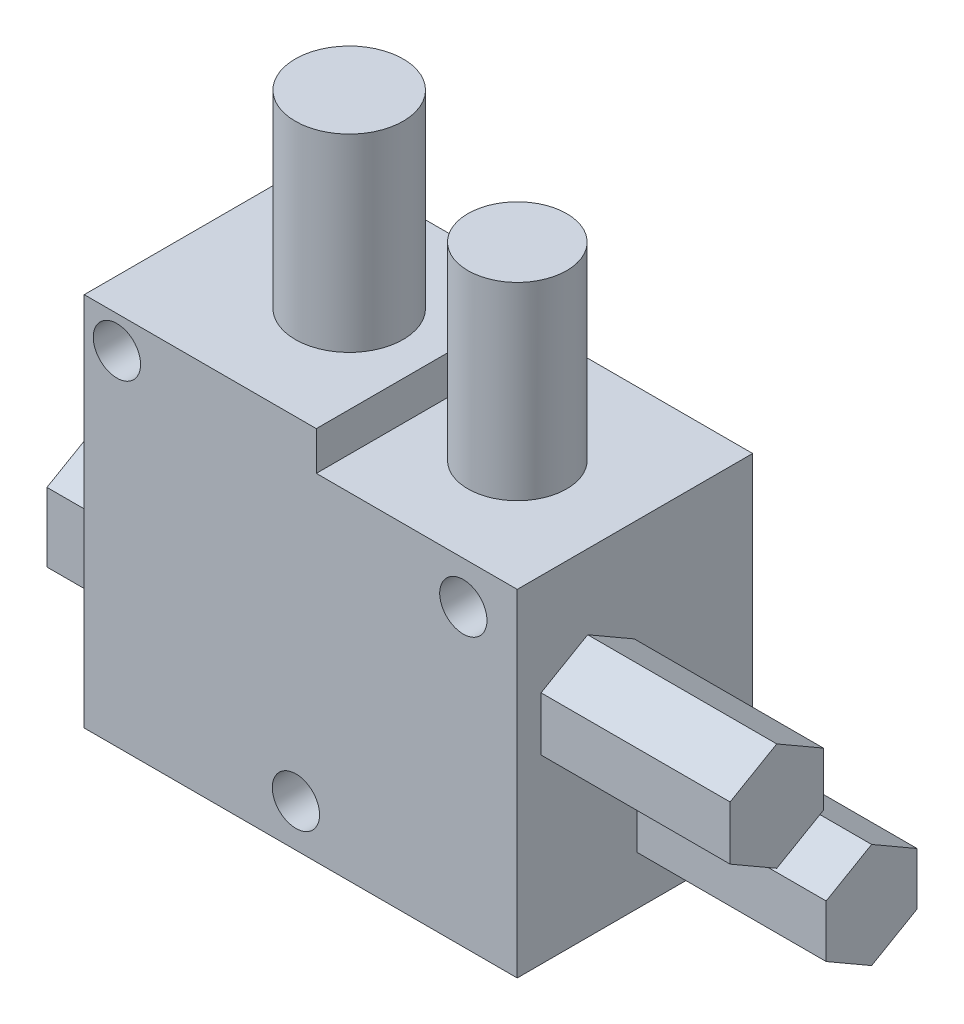
ISO-10303-21;
HEADER;
FILE_DESCRIPTION(('STEP AP214'),'2;1');
FILE_NAME('part.step','',(''),(''),'','','');
FILE_SCHEMA(('AUTOMOTIVE_DESIGN { 1 0 10303 214 1 1 1 1 }'));
ENDSEC;
DATA;
#1=APPLICATION_CONTEXT('core data for automotive mechanical design processes');
#2=APPLICATION_PROTOCOL_DEFINITION('international standard','automotive_design',2000,#1);
#3=PRODUCT_CONTEXT('',#1,'mechanical');
#4=PRODUCT('Part','Part','',(#3));
#5=PRODUCT_RELATED_PRODUCT_CATEGORY('part','',(#4));
#6=PRODUCT_DEFINITION_FORMATION('','',#4);
#7=PRODUCT_DEFINITION_CONTEXT('part definition',#1,'design');
#8=PRODUCT_DEFINITION('design','',#6,#7);
#9=PRODUCT_DEFINITION_SHAPE('','',#8);
#10=(LENGTH_UNIT() NAMED_UNIT(*) SI_UNIT(.MILLI.,.METRE.));
#11=(NAMED_UNIT(*) PLANE_ANGLE_UNIT() SI_UNIT($,.RADIAN.));
#12=(NAMED_UNIT(*) SI_UNIT($,.STERADIAN.) SOLID_ANGLE_UNIT());
#13=UNCERTAINTY_MEASURE_WITH_UNIT(LENGTH_MEASURE(1.E-05),#10,'distance_accuracy_value','');
#14=(GEOMETRIC_REPRESENTATION_CONTEXT(3) GLOBAL_UNCERTAINTY_ASSIGNED_CONTEXT((#13)) GLOBAL_UNIT_ASSIGNED_CONTEXT((#10,
#11,#12)) REPRESENTATION_CONTEXT('',''));
#15=CARTESIAN_POINT('',(0.,0.,0.));
#16=DIRECTION('',(0.,0.,1.));
#17=DIRECTION('',(1.,0.,0.));
#18=AXIS2_PLACEMENT_3D('',#15,#16,#17);
#19=CARTESIAN_POINT('',(-43.8925925925926,53.9952674897119,24.9));
#20=DIRECTION('',(-1.,0.,0.));
#21=DIRECTION('',(0.,-1.,0.));
#22=AXIS2_PLACEMENT_3D('',#19,#20,#21);
#23=PLANE('',#22);
#24=DIRECTION('',(0.,-0.499999999999995,-0.866025403784441));
#25=VECTOR('',#24,1.);
#26=CARTESIAN_POINT('',(-43.8925925925926,33.4669277376455,22.3833900106311));
#27=LINE('',#26,#25);
#28=CARTESIAN_POINT('',(-43.8925925925926,33.4669277376455,22.3833900106311));
#29=VERTEX_POINT('',#28);
#30=CARTESIAN_POINT('',(-43.8925925925926,30.6181451876106,17.4491538942549));
#31=VERTEX_POINT('',#30);
#32=EDGE_CURVE('E218',#29,#31,#27,.T.);
#33=ORIENTED_EDGE('',*,*,#32,.F.);
#34=DIRECTION('',(0.,-1.,0.));
#35=VECTOR('',#34,1.);
#36=CARTESIAN_POINT('',(-43.8925925925926,39.1644928377154,22.3833900106311));
#37=LINE('',#36,#35);
#38=CARTESIAN_POINT('',(-43.8925925925926,39.1644928377155,22.3833900106311));
#39=VERTEX_POINT('',#38);
#40=EDGE_CURVE('E231',#39,#29,#37,.T.);
#41=ORIENTED_EDGE('',*,*,#40,.F.);
#42=DIRECTION('',(0.,-0.500000000000007,0.866025403784434));
#43=VECTOR('',#42,1.);
#44=CARTESIAN_POINT('',(-43.8925925925926,42.0132753877505,17.449153894255));
#45=LINE('',#44,#43);
#46=CARTESIAN_POINT('',(-43.8925925925926,42.0132753877505,17.449153894255));
#47=VERTEX_POINT('',#46);
#48=EDGE_CURVE('E250',#47,#39,#45,.T.);
#49=ORIENTED_EDGE('',*,*,#48,.F.);
#50=DIRECTION('',(0.,0.499999999999995,0.866025403784441));
#51=VECTOR('',#50,1.);
#52=CARTESIAN_POINT('',(-43.8925925925926,39.1644928377155,12.5149177778787));
#53=LINE('',#52,#51);
#54=CARTESIAN_POINT('',(-43.8925925925926,39.1644928377155,12.5149177778787));
#55=VERTEX_POINT('',#54);
#56=EDGE_CURVE('E247',#55,#47,#53,.T.);
#57=ORIENTED_EDGE('',*,*,#56,.F.);
#58=DIRECTION('',(0.,1.,0.));
#59=VECTOR('',#58,1.);
#60=CARTESIAN_POINT('',(-43.8925925925926,33.4669277376456,12.5149177778787));
#61=LINE('',#60,#59);
#62=CARTESIAN_POINT('',(-43.8925925925926,33.4669277376456,12.5149177778787));
#63=VERTEX_POINT('',#62);
#64=EDGE_CURVE('E244',#63,#55,#61,.T.);
#65=ORIENTED_EDGE('',*,*,#64,.F.);
#66=DIRECTION('',(0.,0.500000000000001,-0.866025403784438));
#67=VECTOR('',#66,1.);
#68=CARTESIAN_POINT('',(-43.8925925925926,30.6181451876106,17.4491538942549));
#69=LINE('',#68,#67);
#70=EDGE_CURVE('E221',#31,#63,#69,.T.);
#71=ORIENTED_EDGE('',*,*,#70,.F.);
#72=EDGE_LOOP('',(#33,#41,#49,#57,#65,#71));
#73=FACE_BOUND('',#72,.T.);
#74=DIRECTION('',(0.,1.,0.));
#75=VECTOR('',#74,1.);
#76=CARTESIAN_POINT('',(-43.8925925925926,53.9952674897119,0.));
#77=LINE('',#76,#75);
#78=CARTESIAN_POINT('',(-43.8925925925926,14.2952674897119,0.));
#79=VERTEX_POINT('',#78);
#80=CARTESIAN_POINT('',(-43.8925925925926,49.8952674897119,0.));
#81=VERTEX_POINT('',#80);
#82=EDGE_CURVE('E365',#79,#81,#77,.T.);
#83=ORIENTED_EDGE('',*,*,#82,.T.);
#84=DIRECTION('',(0.,0.,1.));
#85=VECTOR('',#84,1.);
#86=CARTESIAN_POINT('',(-43.8925925925926,49.8952674897119,0.));
#87=LINE('',#86,#85);
#88=CARTESIAN_POINT('',(-43.8925925925926,49.8952674897119,24.9));
#89=VERTEX_POINT('',#88);
#90=EDGE_CURVE('E342',#81,#89,#87,.T.);
#91=ORIENTED_EDGE('',*,*,#90,.T.);
#92=DIRECTION('',(0.,1.,0.));
#93=VECTOR('',#92,1.);
#94=CARTESIAN_POINT('',(-43.8925925925926,53.9952674897119,24.9));
#95=LINE('',#94,#93);
#96=CARTESIAN_POINT('',(-43.8925925925926,14.2952674897119,24.9));
#97=VERTEX_POINT('',#96);
#98=EDGE_CURVE('E355',#97,#89,#95,.T.);
#99=ORIENTED_EDGE('',*,*,#98,.F.);
#100=DIRECTION('',(0.,0.,-1.));
#101=VECTOR('',#100,1.);
#102=CARTESIAN_POINT('',(-43.8925925925926,14.2952674897119,24.9));
#103=LINE('',#102,#101);
#104=EDGE_CURVE('E371',#97,#79,#103,.T.);
#105=ORIENTED_EDGE('',*,*,#104,.T.);
#106=EDGE_LOOP('',(#83,#91,#99,#105));
#107=FACE_BOUND('',#106,.T.);
#108=DIRECTION('',(0.,-0.499999999999995,-0.866025403784441));
#109=VECTOR('',#108,1.);
#110=CARTESIAN_POINT('',(-43.8925925925926,19.4619451368284,12.2209886120208));
#111=LINE('',#110,#109);
#112=CARTESIAN_POINT('',(-43.8925925925926,19.4619451368284,12.2209886120208));
#113=VERTEX_POINT('',#112);
#114=CARTESIAN_POINT('',(-43.8925925925926,16.6866795558266,7.4140876212285));
#115=VERTEX_POINT('',#114);
#116=EDGE_CURVE('E217',#113,#115,#111,.T.);
#117=ORIENTED_EDGE('',*,*,#116,.F.);
#118=DIRECTION('',(0.,-1.,0.));
#119=VECTOR('',#118,1.);
#120=CARTESIAN_POINT('',(-43.8925925925926,25.012476298832,12.2209886120208));
#121=LINE('',#120,#119);
#122=CARTESIAN_POINT('',(-43.8925925925926,25.012476298832,12.2209886120208));
#123=VERTEX_POINT('',#122);
#124=EDGE_CURVE('E214',#123,#113,#121,.T.);
#125=ORIENTED_EDGE('',*,*,#124,.F.);
#126=DIRECTION('',(0.,-0.500000000000007,0.866025403784434));
#127=VECTOR('',#126,1.);
#128=CARTESIAN_POINT('',(-43.8925925925926,27.7877418798339,7.41408762122854));
#129=LINE('',#128,#127);
#130=CARTESIAN_POINT('',(-43.8925925925926,27.7877418798339,7.41408762122854));
#131=VERTEX_POINT('',#130);
#132=EDGE_CURVE('E395',#131,#123,#129,.T.);
#133=ORIENTED_EDGE('',*,*,#132,.F.);
#134=DIRECTION('',(0.,0.499999999999995,0.866025403784441));
#135=VECTOR('',#134,1.);
#136=CARTESIAN_POINT('',(-43.8925925925926,25.0124762988321,2.60718663043621));
#137=LINE('',#136,#135);
#138=CARTESIAN_POINT('',(-43.8925925925926,25.0124762988321,2.60718663043621));
#139=VERTEX_POINT('',#138);
#140=EDGE_CURVE('E392',#139,#131,#137,.T.);
#141=ORIENTED_EDGE('',*,*,#140,.F.);
#142=DIRECTION('',(0.,1.,0.));
#143=VECTOR('',#142,1.);
#144=CARTESIAN_POINT('',(-43.8925925925926,19.4619451368285,2.6071866304362));
#145=LINE('',#144,#143);
#146=CARTESIAN_POINT('',(-43.8925925925926,19.4619451368285,2.60718663043619));
#147=VERTEX_POINT('',#146);
#148=EDGE_CURVE('E56',#147,#139,#145,.T.);
#149=ORIENTED_EDGE('',*,*,#148,.F.);
#150=DIRECTION('',(0.,0.500000000000001,-0.866025403784438));
#151=VECTOR('',#150,1.);
#152=CARTESIAN_POINT('',(-43.8925925925926,16.6866795558267,7.4140876212285));
#153=LINE('',#152,#151);
#154=EDGE_CURVE('E51',#115,#147,#153,.T.);
#155=ORIENTED_EDGE('',*,*,#154,.F.);
#156=EDGE_LOOP('',(#117,#125,#133,#141,#149,#155));
#157=FACE_BOUND('',#156,.T.);
#158=ADVANCED_FACE('F34',(#73,#107,#157),#23,.F.);
#159=CARTESIAN_POINT('',(-89.6925925925926,53.9952674897119,24.9));
#160=DIRECTION('',(1.,0.,0.));
#161=DIRECTION('',(0.,0.,-1.));
#162=AXIS2_PLACEMENT_3D('',#159,#160,#161);
#163=PLANE('',#162);
#164=DIRECTION('',(0.,-1.,0.));
#165=VECTOR('',#164,1.);
#166=CARTESIAN_POINT('',(-89.6925925925926,53.9952674897119,0.));
#167=LINE('',#166,#165);
#168=CARTESIAN_POINT('',(-89.6925925925926,53.9952674897119,0.));
#169=VERTEX_POINT('',#168);
#170=CARTESIAN_POINT('',(-89.6925925925926,14.2952674897119,0.));
#171=VERTEX_POINT('',#170);
#172=EDGE_CURVE('E345',#169,#171,#167,.T.);
#173=ORIENTED_EDGE('',*,*,#172,.T.);
#174=DIRECTION('',(0.,0.,-1.));
#175=VECTOR('',#174,1.);
#176=CARTESIAN_POINT('',(-89.6925925925926,14.2952674897119,24.9));
#177=LINE('',#176,#175);
#178=CARTESIAN_POINT('',(-89.6925925925926,14.2952674897119,24.9));
#179=VERTEX_POINT('',#178);
#180=EDGE_CURVE('E330',#179,#171,#177,.T.);
#181=ORIENTED_EDGE('',*,*,#180,.F.);
#182=DIRECTION('',(0.,-1.,0.));
#183=VECTOR('',#182,1.);
#184=CARTESIAN_POINT('',(-89.6925925925926,53.9952674897119,24.9));
#185=LINE('',#184,#183);
#186=CARTESIAN_POINT('',(-89.6925925925926,53.9952674897119,24.9));
#187=VERTEX_POINT('',#186);
#188=EDGE_CURVE('E349',#187,#179,#185,.T.);
#189=ORIENTED_EDGE('',*,*,#188,.F.);
#190=DIRECTION('',(0.,0.,-1.));
#191=VECTOR('',#190,1.);
#192=CARTESIAN_POINT('',(-89.6925925925926,53.9952674897119,24.9));
#193=LINE('',#192,#191);
#194=EDGE_CURVE('E360',#187,#169,#193,.T.);
#195=ORIENTED_EDGE('',*,*,#194,.T.);
#196=EDGE_LOOP('',(#173,#181,#189,#195));
#197=FACE_BOUND('',#196,.T.);
#198=DIRECTION('',(0.,0.5,0.866025403784438));
#199=VECTOR('',#198,1.);
#200=CARTESIAN_POINT('',(-89.6925925925926,17.3627234957808,12.5235169690332));
#201=LINE('',#200,#199);
#202=CARTESIAN_POINT('',(-89.6925925925926,17.3627234957808,12.5235169690332));
#203=VERTEX_POINT('',#202);
#204=CARTESIAN_POINT('',(-89.6925925925926,21.0129970958527,18.845976305885));
#205=VERTEX_POINT('',#204);
#206=EDGE_CURVE('E272',#203,#205,#201,.T.);
#207=ORIENTED_EDGE('',*,*,#206,.F.);
#208=DIRECTION('',(0.,-0.5,0.866025403784439));
#209=VECTOR('',#208,1.);
#210=CARTESIAN_POINT('',(-89.6925925925926,21.0129970958527,6.20105763218134));
#211=LINE('',#210,#209);
#212=CARTESIAN_POINT('',(-89.6925925925926,21.0129970958527,6.20105763218134));
#213=VERTEX_POINT('',#212);
#214=EDGE_CURVE('E277',#213,#203,#211,.T.);
#215=ORIENTED_EDGE('',*,*,#214,.F.);
#216=DIRECTION('',(0.,-1.,0.));
#217=VECTOR('',#216,1.);
#218=CARTESIAN_POINT('',(-89.6925925925926,28.3135442959964,6.20105763218134));
#219=LINE('',#218,#217);
#220=CARTESIAN_POINT('',(-89.6925925925926,28.3135442959964,6.20105763218134));
#221=VERTEX_POINT('',#220);
#222=EDGE_CURVE('E299',#221,#213,#219,.T.);
#223=ORIENTED_EDGE('',*,*,#222,.F.);
#224=DIRECTION('',(0.,-0.5,-0.866025403784438));
#225=VECTOR('',#224,1.);
#226=CARTESIAN_POINT('',(-89.6925925925926,31.9638178960683,12.5235169690332));
#227=LINE('',#226,#225);
#228=CARTESIAN_POINT('',(-89.6925925925926,31.9638178960683,12.5235169690332));
#229=VERTEX_POINT('',#228);
#230=EDGE_CURVE('E296',#229,#221,#227,.T.);
#231=ORIENTED_EDGE('',*,*,#230,.F.);
#232=DIRECTION('',(0.,0.5,-0.866025403784439));
#233=VECTOR('',#232,1.);
#234=CARTESIAN_POINT('',(-89.6925925925926,28.3135442959964,18.845976305885));
#235=LINE('',#234,#233);
#236=CARTESIAN_POINT('',(-89.6925925925926,28.3135442959964,18.845976305885));
#237=VERTEX_POINT('',#236);
#238=EDGE_CURVE('E293',#237,#229,#235,.T.);
#239=ORIENTED_EDGE('',*,*,#238,.F.);
#240=DIRECTION('',(0.,1.,0.));
#241=VECTOR('',#240,1.);
#242=CARTESIAN_POINT('',(-89.6925925925926,21.0129970958527,18.845976305885));
#243=LINE('',#242,#241);
#244=EDGE_CURVE('E290',#205,#237,#243,.T.);
#245=ORIENTED_EDGE('',*,*,#244,.F.);
#246=EDGE_LOOP('',(#207,#215,#223,#231,#239,#245));
#247=FACE_BOUND('',#246,.T.);
#248=ADVANCED_FACE('F36',(#197,#247),#163,.F.);
#249=CARTESIAN_POINT('',(-89.6925925925926,14.2952674897119,24.9));
#250=DIRECTION('',(0.,1.,0.));
#251=DIRECTION('',(0.,0.,1.));
#252=AXIS2_PLACEMENT_3D('',#249,#250,#251);
#253=PLANE('',#252);
#254=DIRECTION('',(1.,0.,0.));
#255=VECTOR('',#254,1.);
#256=CARTESIAN_POINT('',(-89.6925925925926,14.2952674897119,0.));
#257=LINE('',#256,#255);
#258=EDGE_CURVE('E363',#171,#79,#257,.T.);
#259=ORIENTED_EDGE('',*,*,#258,.T.);
#260=ORIENTED_EDGE('',*,*,#104,.F.);
#261=DIRECTION('',(1.,0.,0.));
#262=VECTOR('',#261,1.);
#263=CARTESIAN_POINT('',(-89.6925925925926,14.2952674897119,24.9));
#264=LINE('',#263,#262);
#265=EDGE_CURVE('E352',#179,#97,#264,.T.);
#266=ORIENTED_EDGE('',*,*,#265,.F.);
#267=ORIENTED_EDGE('',*,*,#180,.T.);
#268=EDGE_LOOP('',(#259,#260,#266,#267));
#269=FACE_BOUND('',#268,.T.);
#270=ADVANCED_FACE('F431',(#269),#253,.F.);
#271=CARTESIAN_POINT('',(-89.6925925925926,53.9952674897119,24.9));
#272=DIRECTION('',(0.,-1.,0.));
#273=DIRECTION('',(0.,0.,-1.));
#274=AXIS2_PLACEMENT_3D('',#271,#272,#273);
#275=PLANE('',#274);
#276=CARTESIAN_POINT('',(-74.419404390684,53.9952674897119,12.1449275280762));
#277=DIRECTION('',(0.,1.,0.));
#278=DIRECTION('',(0.,0.,1.));
#279=AXIS2_PLACEMENT_3D('',#276,#277,#278);
#280=CIRCLE('',#279,5.70788250659148);
#281=CARTESIAN_POINT('',(-74.419404390684,53.9952674897119,17.8528100346677));
#282=VERTEX_POINT('',#281);
#283=EDGE_CURVE('E43',#282,#282,#280,.T.);
#284=ORIENTED_EDGE('',*,*,#283,.F.);
#285=EDGE_LOOP('',(#284));
#286=FACE_BOUND('',#285,.T.);
#287=DIRECTION('',(-1.,0.,0.));
#288=VECTOR('',#287,1.);
#289=CARTESIAN_POINT('',(-89.6925925925926,53.9952674897119,24.9));
#290=LINE('',#289,#288);
#291=CARTESIAN_POINT('',(-65.145256860514,53.9952674897119,24.9));
#292=VERTEX_POINT('',#291);
#293=EDGE_CURVE('E358',#292,#187,#290,.T.);
#294=ORIENTED_EDGE('',*,*,#293,.F.);
#295=DIRECTION('',(0.,0.,1.));
#296=VECTOR('',#295,1.);
#297=CARTESIAN_POINT('',(-65.145256860514,53.9952674897119,0.));
#298=LINE('',#297,#296);
#299=CARTESIAN_POINT('',(-65.145256860514,53.9952674897119,0.));
#300=VERTEX_POINT('',#299);
#301=EDGE_CURVE('E338',#300,#292,#298,.T.);
#302=ORIENTED_EDGE('',*,*,#301,.F.);
#303=DIRECTION('',(-1.,0.,0.));
#304=VECTOR('',#303,1.);
#305=CARTESIAN_POINT('',(-89.6925925925926,53.9952674897119,0.));
#306=LINE('',#305,#304);
#307=EDGE_CURVE('E353',#300,#169,#306,.T.);
#308=ORIENTED_EDGE('',*,*,#307,.T.);
#309=ORIENTED_EDGE('',*,*,#194,.F.);
#310=EDGE_LOOP('',(#294,#302,#308,#309));
#311=FACE_BOUND('',#310,.T.);
#312=ADVANCED_FACE('F435',(#286,#311),#275,.F.);
#313=CARTESIAN_POINT('',(0.,0.,24.9));
#314=DIRECTION('',(0.,0.,1.));
#315=DIRECTION('',(1.,0.,0.));
#316=AXIS2_PLACEMENT_3D('',#313,#314,#315);
#317=PLANE('',#316);
#318=CARTESIAN_POINT('',(-67.3007554404981,18.7909102805088,24.9));
#319=DIRECTION('',(0.,0.,1.));
#320=DIRECTION('',(1.,0.,0.));
#321=AXIS2_PLACEMENT_3D('',#318,#319,#320);
#322=CIRCLE('',#321,2.50000000000001);
#323=CARTESIAN_POINT('',(-64.800755440498,18.7909102805088,24.9));
#324=VERTEX_POINT('',#323);
#325=EDGE_CURVE('E379',#324,#324,#322,.T.);
#326=ORIENTED_EDGE('',*,*,#325,.F.);
#327=EDGE_LOOP('',(#326));
#328=FACE_BOUND('',#327,.T.);
#329=CARTESIAN_POINT('',(-86.2369847961185,50.5780022801136,24.9));
#330=DIRECTION('',(0.,0.,1.));
#331=DIRECTION('',(1.,0.,0.));
#332=AXIS2_PLACEMENT_3D('',#329,#330,#331);
#333=CIRCLE('',#332,2.5);
#334=CARTESIAN_POINT('',(-83.7369847961185,50.5780022801136,24.9));
#335=VERTEX_POINT('',#334);
#336=EDGE_CURVE('E701',#335,#335,#333,.T.);
#337=ORIENTED_EDGE('',*,*,#336,.F.);
#338=EDGE_LOOP('',(#337));
#339=FACE_BOUND('',#338,.T.);
#340=CARTESIAN_POINT('',(-49.5946268103389,45.4459850118288,24.9));
#341=DIRECTION('',(0.,0.,1.));
#342=DIRECTION('',(1.,0.,0.));
#343=AXIS2_PLACEMENT_3D('',#340,#341,#342);
#344=CIRCLE('',#343,2.5);
#345=CARTESIAN_POINT('',(-47.0946268103389,45.4459850118288,24.9));
#346=VERTEX_POINT('',#345);
#347=EDGE_CURVE('E704',#346,#346,#344,.T.);
#348=ORIENTED_EDGE('',*,*,#347,.F.);
#349=EDGE_LOOP('',(#348));
#350=FACE_BOUND('',#349,.T.);
#351=DIRECTION('',(1.,0.,0.));
#352=VECTOR('',#351,1.);
#353=CARTESIAN_POINT('',(-43.8925925925926,49.8952674897119,24.9));
#354=LINE('',#353,#352);
#355=CARTESIAN_POINT('',(-65.145256860514,49.8952674897119,24.9));
#356=VERTEX_POINT('',#355);
#357=EDGE_CURVE('E335',#356,#89,#354,.T.);
#358=ORIENTED_EDGE('',*,*,#357,.F.);
#359=DIRECTION('',(0.,-1.,0.));
#360=VECTOR('',#359,1.);
#361=CARTESIAN_POINT('',(-65.145256860514,49.8952674897119,24.9));
#362=LINE('',#361,#360);
#363=EDGE_CURVE('E327',#292,#356,#362,.T.);
#364=ORIENTED_EDGE('',*,*,#363,.F.);
#365=ORIENTED_EDGE('',*,*,#293,.T.);
#366=ORIENTED_EDGE('',*,*,#188,.T.);
#367=ORIENTED_EDGE('',*,*,#265,.T.);
#368=ORIENTED_EDGE('',*,*,#98,.T.);
#369=EDGE_LOOP('',(#358,#364,#365,#366,#367,#368));
#370=FACE_BOUND('',#369,.T.);
#371=ADVANCED_FACE('F442',(#328,#339,#350,#370),#317,.T.);
#372=CARTESIAN_POINT('',(0.,0.,0.));
#373=DIRECTION('',(0.,0.,1.));
#374=DIRECTION('',(1.,0.,0.));
#375=AXIS2_PLACEMENT_3D('',#372,#373,#374);
#376=PLANE('',#375);
#377=CARTESIAN_POINT('',(-67.3007554404981,18.7909102805088,0.));
#378=DIRECTION('',(0.,0.,1.));
#379=DIRECTION('',(1.,0.,0.));
#380=AXIS2_PLACEMENT_3D('',#377,#378,#379);
#381=CIRCLE('',#380,2.50000000000001);
#382=CARTESIAN_POINT('',(-64.800755440498,18.7909102805088,0.));
#383=VERTEX_POINT('',#382);
#384=EDGE_CURVE('E38',#383,#383,#381,.T.);
#385=ORIENTED_EDGE('',*,*,#384,.T.);
#386=EDGE_LOOP('',(#385));
#387=FACE_BOUND('',#386,.T.);
#388=CARTESIAN_POINT('',(-86.2369847961185,50.5780022801136,0.));
#389=DIRECTION('',(0.,0.,1.));
#390=DIRECTION('',(1.,0.,0.));
#391=AXIS2_PLACEMENT_3D('',#388,#389,#390);
#392=CIRCLE('',#391,2.5);
#393=CARTESIAN_POINT('',(-83.7369847961185,50.5780022801136,0.));
#394=VERTEX_POINT('',#393);
#395=EDGE_CURVE('E378',#394,#394,#392,.T.);
#396=ORIENTED_EDGE('',*,*,#395,.T.);
#397=EDGE_LOOP('',(#396));
#398=FACE_BOUND('',#397,.T.);
#399=CARTESIAN_POINT('',(-49.5946268103389,45.4459850118288,0.));
#400=DIRECTION('',(0.,0.,1.));
#401=DIRECTION('',(1.,0.,0.));
#402=AXIS2_PLACEMENT_3D('',#399,#400,#401);
#403=CIRCLE('',#402,2.5);
#404=CARTESIAN_POINT('',(-47.0946268103389,45.4459850118288,0.));
#405=VERTEX_POINT('',#404);
#406=EDGE_CURVE('E376',#405,#405,#403,.T.);
#407=ORIENTED_EDGE('',*,*,#406,.T.);
#408=EDGE_LOOP('',(#407));
#409=FACE_BOUND('',#408,.T.);
#410=DIRECTION('',(0.,-1.,0.));
#411=VECTOR('',#410,1.);
#412=CARTESIAN_POINT('',(-65.145256860514,49.8952674897119,0.));
#413=LINE('',#412,#411);
#414=CARTESIAN_POINT('',(-65.145256860514,49.8952674897119,0.));
#415=VERTEX_POINT('',#414);
#416=EDGE_CURVE('E331',#300,#415,#413,.T.);
#417=ORIENTED_EDGE('',*,*,#416,.T.);
#418=DIRECTION('',(1.,0.,0.));
#419=VECTOR('',#418,1.);
#420=CARTESIAN_POINT('',(-43.8925925925926,49.8952674897119,0.));
#421=LINE('',#420,#419);
#422=EDGE_CURVE('E334',#415,#81,#421,.T.);
#423=ORIENTED_EDGE('',*,*,#422,.T.);
#424=ORIENTED_EDGE('',*,*,#82,.F.);
#425=ORIENTED_EDGE('',*,*,#258,.F.);
#426=ORIENTED_EDGE('',*,*,#172,.F.);
#427=ORIENTED_EDGE('',*,*,#307,.F.);
#428=EDGE_LOOP('',(#417,#423,#424,#425,#426,#427));
#429=FACE_BOUND('',#428,.T.);
#430=ADVANCED_FACE('F450',(#387,#398,#409,#429),#376,.F.);
#431=CARTESIAN_POINT('',(-43.8925925925926,49.8952674897119,0.));
#432=DIRECTION('',(0.,-1.,0.));
#433=DIRECTION('',(0.,0.,-1.));
#434=AXIS2_PLACEMENT_3D('',#431,#432,#433);
#435=PLANE('',#434);
#436=CARTESIAN_POINT('',(-55.7010291490825,49.8952674897119,13.081935834699));
#437=DIRECTION('',(0.,-1.,0.));
#438=DIRECTION('',(0.,0.,-1.));
#439=AXIS2_PLACEMENT_3D('',#436,#437,#438);
#440=CIRCLE('',#439,5.22399966830635);
#441=CARTESIAN_POINT('',(-55.7010291490825,49.8952674897119,7.85793616639261));
#442=VERTEX_POINT('',#441);
#443=EDGE_CURVE('E11',#442,#442,#440,.F.);
#444=ORIENTED_EDGE('',*,*,#443,.F.);
#445=EDGE_LOOP('',(#444));
#446=FACE_BOUND('',#445,.T.);
#447=ORIENTED_EDGE('',*,*,#357,.T.);
#448=ORIENTED_EDGE('',*,*,#90,.F.);
#449=ORIENTED_EDGE('',*,*,#422,.F.);
#450=DIRECTION('',(0.,0.,1.));
#451=VECTOR('',#450,1.);
#452=CARTESIAN_POINT('',(-65.145256860514,49.8952674897119,0.));
#453=LINE('',#452,#451);
#454=EDGE_CURVE('E346',#415,#356,#453,.T.);
#455=ORIENTED_EDGE('',*,*,#454,.T.);
#456=EDGE_LOOP('',(#447,#448,#449,#455));
#457=FACE_BOUND('',#456,.T.);
#458=ADVANCED_FACE('F454',(#446,#457),#435,.F.);
#459=CARTESIAN_POINT('',(-65.145256860514,49.8952674897119,0.));
#460=DIRECTION('',(-1.,0.,0.));
#461=DIRECTION('',(0.,0.,1.));
#462=AXIS2_PLACEMENT_3D('',#459,#460,#461);
#463=PLANE('',#462);
#464=ORIENTED_EDGE('',*,*,#363,.T.);
#465=ORIENTED_EDGE('',*,*,#454,.F.);
#466=ORIENTED_EDGE('',*,*,#416,.F.);
#467=ORIENTED_EDGE('',*,*,#301,.T.);
#468=EDGE_LOOP('',(#464,#465,#466,#467));
#469=FACE_BOUND('',#468,.T.);
#470=ADVANCED_FACE('F456',(#469),#463,.F.);
#471=CARTESIAN_POINT('',(-74.419404390684,73.9952674897119,12.1449275280762));
#472=DIRECTION('',(0.,-1.,0.));
#473=DIRECTION('',(0.,0.,-1.));
#474=AXIS2_PLACEMENT_3D('',#471,#472,#473);
#475=CYLINDRICAL_SURFACE('',#474,5.70788250659148);
#476=CARTESIAN_POINT('',(-74.419404390684,73.9952674897119,12.1449275280762));
#477=DIRECTION('',(0.,1.,0.));
#478=DIRECTION('',(0.,0.,1.));
#479=AXIS2_PLACEMENT_3D('',#476,#477,#478);
#480=CIRCLE('',#479,5.70788250659148);
#481=CARTESIAN_POINT('',(-74.419404390684,73.9952674897119,17.8528100346677));
#482=VERTEX_POINT('',#481);
#483=EDGE_CURVE('E324',#482,#482,#480,.T.);
#484=ORIENTED_EDGE('',*,*,#483,.F.);
#485=EDGE_LOOP('',(#484));
#486=FACE_BOUND('',#485,.T.);
#487=ORIENTED_EDGE('',*,*,#283,.T.);
#488=EDGE_LOOP('',(#487));
#489=FACE_BOUND('',#488,.T.);
#490=ADVANCED_FACE('F512',(#486,#489),#475,.T.);
#491=CARTESIAN_POINT('',(-74.419404390684,73.9952674897119,12.1449275280762));
#492=DIRECTION('',(0.,1.,0.));
#493=DIRECTION('',(0.,0.,1.));
#494=AXIS2_PLACEMENT_3D('',#491,#492,#493);
#495=PLANE('',#494);
#496=ORIENTED_EDGE('',*,*,#483,.T.);
#497=EDGE_LOOP('',(#496));
#498=FACE_BOUND('',#497,.T.);
#499=ADVANCED_FACE('F508',(#498),#495,.T.);
#500=CARTESIAN_POINT('',(-55.7010291490825,69.8952674897119,13.081935834699));
#501=DIRECTION('',(0.,-1.,0.));
#502=DIRECTION('',(0.,0.,-1.));
#503=AXIS2_PLACEMENT_3D('',#500,#501,#502);
#504=CYLINDRICAL_SURFACE('',#503,5.22399966830635);
#505=CARTESIAN_POINT('',(-55.7010291490825,69.8952674897119,13.081935834699));
#506=DIRECTION('',(0.,1.,0.));
#507=DIRECTION('',(0.,0.,1.));
#508=AXIS2_PLACEMENT_3D('',#505,#506,#507);
#509=CIRCLE('',#508,5.22399966830635);
#510=CARTESIAN_POINT('',(-55.7010291490825,69.8952674897119,18.3059355030053));
#511=VERTEX_POINT('',#510);
#512=EDGE_CURVE('E321',#511,#511,#509,.T.);
#513=ORIENTED_EDGE('',*,*,#512,.F.);
#514=EDGE_LOOP('',(#513));
#515=FACE_BOUND('',#514,.T.);
#516=ORIENTED_EDGE('',*,*,#443,.T.);
#517=EDGE_LOOP('',(#516));
#518=FACE_BOUND('',#517,.T.);
#519=ADVANCED_FACE('F504',(#515,#518),#504,.T.);
#520=CARTESIAN_POINT('',(-55.7010291490825,69.8952674897119,13.081935834699));
#521=DIRECTION('',(0.,1.,0.));
#522=DIRECTION('',(0.,0.,1.));
#523=AXIS2_PLACEMENT_3D('',#520,#521,#522);
#524=PLANE('',#523);
#525=ORIENTED_EDGE('',*,*,#512,.T.);
#526=EDGE_LOOP('',(#525));
#527=FACE_BOUND('',#526,.T.);
#528=ADVANCED_FACE('F498',(#527),#524,.T.);
#529=CARTESIAN_POINT('',(-99.6925925925926,17.3627234957808,12.5235169690332));
#530=DIRECTION('',(0.,0.866025403784438,-0.5));
#531=DIRECTION('',(0.,0.5,0.866025403784438));
#532=AXIS2_PLACEMENT_3D('',#529,#530,#531);
#533=PLANE('',#532);
#534=ORIENTED_EDGE('',*,*,#206,.T.);
#535=DIRECTION('',(1.,0.,0.));
#536=VECTOR('',#535,1.);
#537=CARTESIAN_POINT('',(-99.6925925925926,21.0129970958527,18.845976305885));
#538=LINE('',#537,#536);
#539=CARTESIAN_POINT('',(-99.6925925925926,21.0129970958527,18.845976305885));
#540=VERTEX_POINT('',#539);
#541=EDGE_CURVE('E318',#540,#205,#538,.T.);
#542=ORIENTED_EDGE('',*,*,#541,.F.);
#543=DIRECTION('',(0.,0.5,0.866025403784438));
#544=VECTOR('',#543,1.);
#545=CARTESIAN_POINT('',(-99.6925925925926,17.3627234957808,12.5235169690332));
#546=LINE('',#545,#544);
#547=CARTESIAN_POINT('',(-99.6925925925926,17.3627234957808,12.5235169690332));
#548=VERTEX_POINT('',#547);
#549=EDGE_CURVE('E273',#548,#540,#546,.T.);
#550=ORIENTED_EDGE('',*,*,#549,.F.);
#551=DIRECTION('',(1.,0.,0.));
#552=VECTOR('',#551,1.);
#553=CARTESIAN_POINT('',(-99.6925925925926,17.3627234957808,12.5235169690332));
#554=LINE('',#553,#552);
#555=EDGE_CURVE('E287',#548,#203,#554,.T.);
#556=ORIENTED_EDGE('',*,*,#555,.T.);
#557=EDGE_LOOP('',(#534,#542,#550,#556));
#558=FACE_BOUND('',#557,.T.);
#559=ADVANCED_FACE('F474',(#558),#533,.F.);
#560=CARTESIAN_POINT('',(-99.6925925925926,21.0129970958527,18.845976305885));
#561=DIRECTION('',(0.,0.,-1.));
#562=DIRECTION('',(-1.,0.,0.));
#563=AXIS2_PLACEMENT_3D('',#560,#561,#562);
#564=PLANE('',#563);
#565=ORIENTED_EDGE('',*,*,#244,.T.);
#566=DIRECTION('',(1.,0.,0.));
#567=VECTOR('',#566,1.);
#568=CARTESIAN_POINT('',(-99.6925925925926,28.3135442959964,18.845976305885));
#569=LINE('',#568,#567);
#570=CARTESIAN_POINT('',(-99.6925925925926,28.3135442959964,18.845976305885));
#571=VERTEX_POINT('',#570);
#572=EDGE_CURVE('E315',#571,#237,#569,.T.);
#573=ORIENTED_EDGE('',*,*,#572,.F.);
#574=DIRECTION('',(0.,1.,0.));
#575=VECTOR('',#574,1.);
#576=CARTESIAN_POINT('',(-99.6925925925926,21.0129970958527,18.845976305885));
#577=LINE('',#576,#575);
#578=EDGE_CURVE('E276',#540,#571,#577,.T.);
#579=ORIENTED_EDGE('',*,*,#578,.F.);
#580=ORIENTED_EDGE('',*,*,#541,.T.);
#581=EDGE_LOOP('',(#565,#573,#579,#580));
#582=FACE_BOUND('',#581,.T.);
#583=ADVANCED_FACE('F490',(#582),#564,.F.);
#584=CARTESIAN_POINT('',(-99.6925925925926,28.3135442959964,18.845976305885));
#585=DIRECTION('',(0.,-0.866025403784439,-0.5));
#586=DIRECTION('',(0.,0.5,-0.866025403784439));
#587=AXIS2_PLACEMENT_3D('',#584,#585,#586);
#588=PLANE('',#587);
#589=ORIENTED_EDGE('',*,*,#238,.T.);
#590=DIRECTION('',(1.,0.,0.));
#591=VECTOR('',#590,1.);
#592=CARTESIAN_POINT('',(-99.6925925925926,31.9638178960683,12.5235169690332));
#593=LINE('',#592,#591);
#594=CARTESIAN_POINT('',(-99.6925925925926,31.9638178960683,12.5235169690332));
#595=VERTEX_POINT('',#594);
#596=EDGE_CURVE('E312',#595,#229,#593,.T.);
#597=ORIENTED_EDGE('',*,*,#596,.F.);
#598=DIRECTION('',(0.,0.5,-0.866025403784439));
#599=VECTOR('',#598,1.);
#600=CARTESIAN_POINT('',(-99.6925925925926,28.3135442959964,18.845976305885));
#601=LINE('',#600,#599);
#602=EDGE_CURVE('E279',#571,#595,#601,.T.);
#603=ORIENTED_EDGE('',*,*,#602,.F.);
#604=ORIENTED_EDGE('',*,*,#572,.T.);
#605=EDGE_LOOP('',(#589,#597,#603,#604));
#606=FACE_BOUND('',#605,.T.);
#607=ADVANCED_FACE('F488',(#606),#588,.F.);
#608=CARTESIAN_POINT('',(-99.6925925925926,31.9638178960683,12.5235169690332));
#609=DIRECTION('',(0.,-0.866025403784438,0.5));
#610=DIRECTION('',(0.,-0.5,-0.866025403784438));
#611=AXIS2_PLACEMENT_3D('',#608,#609,#610);
#612=PLANE('',#611);
#613=ORIENTED_EDGE('',*,*,#230,.T.);
#614=DIRECTION('',(1.,0.,0.));
#615=VECTOR('',#614,1.);
#616=CARTESIAN_POINT('',(-99.6925925925926,28.3135442959964,6.20105763218134));
#617=LINE('',#616,#615);
#618=CARTESIAN_POINT('',(-99.6925925925926,28.3135442959964,6.20105763218134));
#619=VERTEX_POINT('',#618);
#620=EDGE_CURVE('E309',#619,#221,#617,.T.);
#621=ORIENTED_EDGE('',*,*,#620,.F.);
#622=DIRECTION('',(0.,-0.5,-0.866025403784438));
#623=VECTOR('',#622,1.);
#624=CARTESIAN_POINT('',(-99.6925925925926,31.9638178960683,12.5235169690332));
#625=LINE('',#624,#623);
#626=EDGE_CURVE('E281',#595,#619,#625,.T.);
#627=ORIENTED_EDGE('',*,*,#626,.F.);
#628=ORIENTED_EDGE('',*,*,#596,.T.);
#629=EDGE_LOOP('',(#613,#621,#627,#628));
#630=FACE_BOUND('',#629,.T.);
#631=ADVANCED_FACE('F484',(#630),#612,.F.);
#632=CARTESIAN_POINT('',(-99.6925925925926,28.3135442959964,6.20105763218134));
#633=DIRECTION('',(0.,0.,1.));
#634=DIRECTION('',(0.,-1.,0.));
#635=AXIS2_PLACEMENT_3D('',#632,#633,#634);
#636=PLANE('',#635);
#637=ORIENTED_EDGE('',*,*,#222,.T.);
#638=DIRECTION('',(1.,0.,0.));
#639=VECTOR('',#638,1.);
#640=CARTESIAN_POINT('',(-99.6925925925926,21.0129970958527,6.20105763218134));
#641=LINE('',#640,#639);
#642=CARTESIAN_POINT('',(-99.6925925925926,21.0129970958527,6.20105763218134));
#643=VERTEX_POINT('',#642);
#644=EDGE_CURVE('E306',#643,#213,#641,.T.);
#645=ORIENTED_EDGE('',*,*,#644,.F.);
#646=DIRECTION('',(0.,-1.,0.));
#647=VECTOR('',#646,1.);
#648=CARTESIAN_POINT('',(-99.6925925925926,28.3135442959964,6.20105763218134));
#649=LINE('',#648,#647);
#650=EDGE_CURVE('E283',#619,#643,#649,.T.);
#651=ORIENTED_EDGE('',*,*,#650,.F.);
#652=ORIENTED_EDGE('',*,*,#620,.T.);
#653=EDGE_LOOP('',(#637,#645,#651,#652));
#654=FACE_BOUND('',#653,.T.);
#655=ADVANCED_FACE('F482',(#654),#636,.F.);
#656=CARTESIAN_POINT('',(-99.6925925925926,21.0129970958527,6.20105763218134));
#657=DIRECTION('',(0.,0.866025403784439,0.5));
#658=DIRECTION('',(0.,-0.5,0.866025403784439));
#659=AXIS2_PLACEMENT_3D('',#656,#657,#658);
#660=PLANE('',#659);
#661=ORIENTED_EDGE('',*,*,#214,.T.);
#662=ORIENTED_EDGE('',*,*,#555,.F.);
#663=DIRECTION('',(0.,-0.5,0.866025403784439));
#664=VECTOR('',#663,1.);
#665=CARTESIAN_POINT('',(-99.6925925925926,21.0129970958527,6.20105763218134));
#666=LINE('',#665,#664);
#667=EDGE_CURVE('E285',#643,#548,#666,.T.);
#668=ORIENTED_EDGE('',*,*,#667,.F.);
#669=ORIENTED_EDGE('',*,*,#644,.T.);
#670=EDGE_LOOP('',(#661,#662,#668,#669));
#671=FACE_BOUND('',#670,.T.);
#672=ADVANCED_FACE('F470',(#671),#660,.F.);
#673=CARTESIAN_POINT('',(-99.6925925925926,0.,0.));
#674=DIRECTION('',(-1.,0.,0.));
#675=DIRECTION('',(0.,0.,1.));
#676=AXIS2_PLACEMENT_3D('',#673,#674,#675);
#677=PLANE('',#676);
#678=ORIENTED_EDGE('',*,*,#549,.T.);
#679=ORIENTED_EDGE('',*,*,#578,.T.);
#680=ORIENTED_EDGE('',*,*,#602,.T.);
#681=ORIENTED_EDGE('',*,*,#626,.T.);
#682=ORIENTED_EDGE('',*,*,#650,.T.);
#683=ORIENTED_EDGE('',*,*,#667,.T.);
#684=EDGE_LOOP('',(#678,#679,#680,#681,#682,#683));
#685=FACE_BOUND('',#684,.T.);
#686=ADVANCED_FACE('F476',(#685),#677,.T.);
#687=CARTESIAN_POINT('',(-23.8925925925926,33.4669277376455,22.3833900106311));
#688=DIRECTION('',(0.,0.866025403784441,-0.499999999999995));
#689=DIRECTION('',(0.,0.499999999999995,0.866025403784441));
#690=AXIS2_PLACEMENT_3D('',#687,#688,#689);
#691=PLANE('',#690);
#692=ORIENTED_EDGE('',*,*,#32,.T.);
#693=DIRECTION('',(-1.,0.,0.));
#694=VECTOR('',#693,1.);
#695=CARTESIAN_POINT('',(-23.8925925925926,30.6181451876106,17.4491538942549));
#696=LINE('',#695,#694);
#697=CARTESIAN_POINT('',(-23.8925925925926,30.6181451876106,17.4491538942549));
#698=VERTEX_POINT('',#697);
#699=EDGE_CURVE('E269',#698,#31,#696,.T.);
#700=ORIENTED_EDGE('',*,*,#699,.F.);
#701=DIRECTION('',(0.,-0.499999999999995,-0.866025403784441));
#702=VECTOR('',#701,1.);
#703=CARTESIAN_POINT('',(-23.8925925925926,33.4669277376455,22.3833900106311));
#704=LINE('',#703,#702);
#705=CARTESIAN_POINT('',(-23.8925925925926,33.4669277376455,22.3833900106311));
#706=VERTEX_POINT('',#705);
#707=EDGE_CURVE('E227',#706,#698,#704,.T.);
#708=ORIENTED_EDGE('',*,*,#707,.F.);
#709=DIRECTION('',(-1.,0.,0.));
#710=VECTOR('',#709,1.);
#711=CARTESIAN_POINT('',(-23.8925925925926,33.4669277376455,22.3833900106311));
#712=LINE('',#711,#710);
#713=EDGE_CURVE('E240',#706,#29,#712,.T.);
#714=ORIENTED_EDGE('',*,*,#713,.T.);
#715=EDGE_LOOP('',(#692,#700,#708,#714));
#716=FACE_BOUND('',#715,.T.);
#717=ADVANCED_FACE('F581',(#716),#691,.F.);
#718=CARTESIAN_POINT('',(-23.8925925925926,30.6181451876106,17.4491538942549));
#719=DIRECTION('',(0.,0.866025403784438,0.500000000000001));
#720=DIRECTION('',(0.,-0.500000000000001,0.866025403784438));
#721=AXIS2_PLACEMENT_3D('',#718,#719,#720);
#722=PLANE('',#721);
#723=ORIENTED_EDGE('',*,*,#70,.T.);
#724=DIRECTION('',(-1.,0.,0.));
#725=VECTOR('',#724,1.);
#726=CARTESIAN_POINT('',(-23.8925925925926,33.4669277376456,12.5149177778787));
#727=LINE('',#726,#725);
#728=CARTESIAN_POINT('',(-23.8925925925926,33.4669277376456,12.5149177778787));
#729=VERTEX_POINT('',#728);
#730=EDGE_CURVE('E266',#729,#63,#727,.T.);
#731=ORIENTED_EDGE('',*,*,#730,.F.);
#732=DIRECTION('',(0.,0.500000000000001,-0.866025403784438));
#733=VECTOR('',#732,1.);
#734=CARTESIAN_POINT('',(-23.8925925925926,30.6181451876106,17.4491538942549));
#735=LINE('',#734,#733);
#736=EDGE_CURVE('E230',#698,#729,#735,.T.);
#737=ORIENTED_EDGE('',*,*,#736,.F.);
#738=ORIENTED_EDGE('',*,*,#699,.T.);
#739=EDGE_LOOP('',(#723,#731,#737,#738));
#740=FACE_BOUND('',#739,.T.);
#741=ADVANCED_FACE('F577',(#740),#722,.F.);
#742=CARTESIAN_POINT('',(-23.8925925925926,33.4669277376456,12.5149177778787));
#743=DIRECTION('',(0.,0.,1.));
#744=DIRECTION('',(0.,-1.,0.));
#745=AXIS2_PLACEMENT_3D('',#742,#743,#744);
#746=PLANE('',#745);
#747=ORIENTED_EDGE('',*,*,#64,.T.);
#748=DIRECTION('',(-1.,0.,0.));
#749=VECTOR('',#748,1.);
#750=CARTESIAN_POINT('',(-23.8925925925926,39.1644928377155,12.5149177778787));
#751=LINE('',#750,#749);
#752=CARTESIAN_POINT('',(-23.8925925925926,39.1644928377155,12.5149177778787));
#753=VERTEX_POINT('',#752);
#754=EDGE_CURVE('E263',#753,#55,#751,.T.);
#755=ORIENTED_EDGE('',*,*,#754,.F.);
#756=DIRECTION('',(0.,1.,0.));
#757=VECTOR('',#756,1.);
#758=CARTESIAN_POINT('',(-23.8925925925926,33.4669277376456,12.5149177778787));
#759=LINE('',#758,#757);
#760=EDGE_CURVE('E233',#729,#753,#759,.T.);
#761=ORIENTED_EDGE('',*,*,#760,.F.);
#762=ORIENTED_EDGE('',*,*,#730,.T.);
#763=EDGE_LOOP('',(#747,#755,#761,#762));
#764=FACE_BOUND('',#763,.T.);
#765=ADVANCED_FACE('F573',(#764),#746,.F.);
#766=CARTESIAN_POINT('',(-23.8925925925926,39.1644928377155,12.5149177778787));
#767=DIRECTION('',(0.,-0.866025403784441,0.499999999999995));
#768=DIRECTION('',(0.,-0.499999999999995,-0.866025403784441));
#769=AXIS2_PLACEMENT_3D('',#766,#767,#768);
#770=PLANE('',#769);
#771=ORIENTED_EDGE('',*,*,#56,.T.);
#772=DIRECTION('',(-1.,0.,0.));
#773=VECTOR('',#772,1.);
#774=CARTESIAN_POINT('',(-23.8925925925926,42.0132753877505,17.449153894255));
#775=LINE('',#774,#773);
#776=CARTESIAN_POINT('',(-23.8925925925926,42.0132753877505,17.449153894255));
#777=VERTEX_POINT('',#776);
#778=EDGE_CURVE('E260',#777,#47,#775,.T.);
#779=ORIENTED_EDGE('',*,*,#778,.F.);
#780=DIRECTION('',(0.,0.499999999999995,0.866025403784441));
#781=VECTOR('',#780,1.);
#782=CARTESIAN_POINT('',(-23.8925925925926,39.1644928377155,12.5149177778787));
#783=LINE('',#782,#781);
#784=EDGE_CURVE('E235',#753,#777,#783,.T.);
#785=ORIENTED_EDGE('',*,*,#784,.F.);
#786=ORIENTED_EDGE('',*,*,#754,.T.);
#787=EDGE_LOOP('',(#771,#779,#785,#786));
#788=FACE_BOUND('',#787,.T.);
#789=ADVANCED_FACE('F569',(#788),#770,.F.);
#790=CARTESIAN_POINT('',(-23.8925925925926,42.0132753877505,17.449153894255));
#791=DIRECTION('',(0.,-0.866025403784434,-0.500000000000007));
#792=DIRECTION('',(0.,0.500000000000007,-0.866025403784434));
#793=AXIS2_PLACEMENT_3D('',#790,#791,#792);
#794=PLANE('',#793);
#795=ORIENTED_EDGE('',*,*,#48,.T.);
#796=DIRECTION('',(-1.,0.,0.));
#797=VECTOR('',#796,1.);
#798=CARTESIAN_POINT('',(-23.8925925925926,39.1644928377155,22.3833900106311));
#799=LINE('',#798,#797);
#800=CARTESIAN_POINT('',(-23.8925925925926,39.1644928377155,22.3833900106311));
#801=VERTEX_POINT('',#800);
#802=EDGE_CURVE('E257',#801,#39,#799,.T.);
#803=ORIENTED_EDGE('',*,*,#802,.F.);
#804=DIRECTION('',(0.,-0.500000000000007,0.866025403784434));
#805=VECTOR('',#804,1.);
#806=CARTESIAN_POINT('',(-23.8925925925926,42.0132753877505,17.449153894255));
#807=LINE('',#806,#805);
#808=EDGE_CURVE('E237',#777,#801,#807,.T.);
#809=ORIENTED_EDGE('',*,*,#808,.F.);
#810=ORIENTED_EDGE('',*,*,#778,.T.);
#811=EDGE_LOOP('',(#795,#803,#809,#810));
#812=FACE_BOUND('',#811,.T.);
#813=ADVANCED_FACE('F565',(#812),#794,.F.);
#814=CARTESIAN_POINT('',(-23.8925925925926,39.1644928377155,22.3833900106311));
#815=DIRECTION('',(0.,0.,-1.));
#816=DIRECTION('',(0.,1.,0.));
#817=AXIS2_PLACEMENT_3D('',#814,#815,#816);
#818=PLANE('',#817);
#819=ORIENTED_EDGE('',*,*,#40,.T.);
#820=ORIENTED_EDGE('',*,*,#713,.F.);
#821=DIRECTION('',(0.,-1.,0.));
#822=VECTOR('',#821,1.);
#823=CARTESIAN_POINT('',(-23.8925925925926,39.1644928377155,22.3833900106311));
#824=LINE('',#823,#822);
#825=EDGE_CURVE('E239',#801,#706,#824,.T.);
#826=ORIENTED_EDGE('',*,*,#825,.F.);
#827=ORIENTED_EDGE('',*,*,#802,.T.);
#828=EDGE_LOOP('',(#819,#820,#826,#827));
#829=FACE_BOUND('',#828,.T.);
#830=ADVANCED_FACE('F561',(#829),#818,.F.);
#831=CARTESIAN_POINT('',(-23.8925925925926,0.,0.));
#832=DIRECTION('',(1.,0.,0.));
#833=DIRECTION('',(0.,0.,-1.));
#834=AXIS2_PLACEMENT_3D('',#831,#832,#833);
#835=PLANE('',#834);
#836=ORIENTED_EDGE('',*,*,#707,.T.);
#837=ORIENTED_EDGE('',*,*,#736,.T.);
#838=ORIENTED_EDGE('',*,*,#760,.T.);
#839=ORIENTED_EDGE('',*,*,#784,.T.);
#840=ORIENTED_EDGE('',*,*,#808,.T.);
#841=ORIENTED_EDGE('',*,*,#825,.T.);
#842=EDGE_LOOP('',(#836,#837,#838,#839,#840,#841));
#843=FACE_BOUND('',#842,.T.);
#844=ADVANCED_FACE('F558',(#843),#835,.T.);
#845=CARTESIAN_POINT('',(-23.8925925925926,19.4619451368284,12.2209886120208));
#846=DIRECTION('',(0.,0.866025403784441,-0.499999999999995));
#847=DIRECTION('',(0.,0.499999999999995,0.866025403784441));
#848=AXIS2_PLACEMENT_3D('',#845,#846,#847);
#849=PLANE('',#848);
#850=ORIENTED_EDGE('',*,*,#116,.T.);
#851=DIRECTION('',(-1.,0.,0.));
#852=VECTOR('',#851,1.);
#853=CARTESIAN_POINT('',(-23.8925925925926,16.6866795558267,7.4140876212285));
#854=LINE('',#853,#852);
#855=CARTESIAN_POINT('',(-23.8925925925926,16.6866795558267,7.4140876212285));
#856=VERTEX_POINT('',#855);
#857=EDGE_CURVE('E198',#856,#115,#854,.T.);
#858=ORIENTED_EDGE('',*,*,#857,.F.);
#859=DIRECTION('',(0.,-0.499999999999995,-0.866025403784441));
#860=VECTOR('',#859,1.);
#861=CARTESIAN_POINT('',(-23.8925925925926,19.4619451368284,12.2209886120208));
#862=LINE('',#861,#860);
#863=CARTESIAN_POINT('',(-23.8925925925926,19.4619451368284,12.2209886120208));
#864=VERTEX_POINT('',#863);
#865=EDGE_CURVE('E205',#864,#856,#862,.T.);
#866=ORIENTED_EDGE('',*,*,#865,.F.);
#867=DIRECTION('',(-1.,0.,0.));
#868=VECTOR('',#867,1.);
#869=CARTESIAN_POINT('',(-23.8925925925926,19.4619451368284,12.2209886120208));
#870=LINE('',#869,#868);
#871=EDGE_CURVE('E400',#864,#113,#870,.T.);
#872=ORIENTED_EDGE('',*,*,#871,.T.);
#873=EDGE_LOOP('',(#850,#858,#866,#872));
#874=FACE_BOUND('',#873,.T.);
#875=ADVANCED_FACE('F216',(#874),#849,.F.);
#876=CARTESIAN_POINT('',(-23.8925925925926,16.6866795558267,7.4140876212285));
#877=DIRECTION('',(0.,0.866025403784438,0.500000000000001));
#878=DIRECTION('',(0.,-0.500000000000001,0.866025403784438));
#879=AXIS2_PLACEMENT_3D('',#876,#877,#878);
#880=PLANE('',#879);
#881=ORIENTED_EDGE('',*,*,#154,.T.);
#882=DIRECTION('',(-1.,0.,0.));
#883=VECTOR('',#882,1.);
#884=CARTESIAN_POINT('',(-23.8925925925926,19.4619451368285,2.6071866304362));
#885=LINE('',#884,#883);
#886=CARTESIAN_POINT('',(-23.8925925925926,19.4619451368285,2.6071866304362));
#887=VERTEX_POINT('',#886);
#888=EDGE_CURVE('E201',#887,#147,#885,.T.);
#889=ORIENTED_EDGE('',*,*,#888,.F.);
#890=DIRECTION('',(0.,0.500000000000001,-0.866025403784438));
#891=VECTOR('',#890,1.);
#892=CARTESIAN_POINT('',(-23.8925925925926,16.6866795558267,7.4140876212285));
#893=LINE('',#892,#891);
#894=EDGE_CURVE('E194',#856,#887,#893,.T.);
#895=ORIENTED_EDGE('',*,*,#894,.F.);
#896=ORIENTED_EDGE('',*,*,#857,.T.);
#897=EDGE_LOOP('',(#881,#889,#895,#896));
#898=FACE_BOUND('',#897,.T.);
#899=ADVANCED_FACE('F196',(#898),#880,.F.);
#900=CARTESIAN_POINT('',(-23.8925925925926,19.4619451368285,2.6071866304362));
#901=DIRECTION('',(0.,0.,1.));
#902=DIRECTION('',(0.,-1.,0.));
#903=AXIS2_PLACEMENT_3D('',#900,#901,#902);
#904=PLANE('',#903);
#905=ORIENTED_EDGE('',*,*,#148,.T.);
#906=DIRECTION('',(-1.,0.,0.));
#907=VECTOR('',#906,1.);
#908=CARTESIAN_POINT('',(-23.8925925925926,25.0124762988321,2.60718663043621));
#909=LINE('',#908,#907);
#910=CARTESIAN_POINT('',(-23.8925925925926,25.0124762988321,2.60718663043621));
#911=VERTEX_POINT('',#910);
#912=EDGE_CURVE('E223',#911,#139,#909,.T.);
#913=ORIENTED_EDGE('',*,*,#912,.F.);
#914=DIRECTION('',(0.,1.,0.));
#915=VECTOR('',#914,1.);
#916=CARTESIAN_POINT('',(-23.8925925925926,19.4619451368285,2.6071866304362));
#917=LINE('',#916,#915);
#918=EDGE_CURVE('E204',#887,#911,#917,.T.);
#919=ORIENTED_EDGE('',*,*,#918,.F.);
#920=ORIENTED_EDGE('',*,*,#888,.T.);
#921=EDGE_LOOP('',(#905,#913,#919,#920));
#922=FACE_BOUND('',#921,.T.);
#923=ADVANCED_FACE('F415',(#922),#904,.F.);
#924=CARTESIAN_POINT('',(-23.8925925925926,25.0124762988321,2.60718663043621));
#925=DIRECTION('',(0.,-0.866025403784441,0.499999999999995));
#926=DIRECTION('',(0.,-0.499999999999995,-0.866025403784441));
#927=AXIS2_PLACEMENT_3D('',#924,#925,#926);
#928=PLANE('',#927);
#929=ORIENTED_EDGE('',*,*,#140,.T.);
#930=DIRECTION('',(-1.,0.,0.));
#931=VECTOR('',#930,1.);
#932=CARTESIAN_POINT('',(-23.8925925925926,27.7877418798339,7.41408762122854));
#933=LINE('',#932,#931);
#934=CARTESIAN_POINT('',(-23.8925925925926,27.7877418798339,7.41408762122854));
#935=VERTEX_POINT('',#934);
#936=EDGE_CURVE('E405',#935,#131,#933,.T.);
#937=ORIENTED_EDGE('',*,*,#936,.F.);
#938=DIRECTION('',(0.,0.499999999999995,0.866025403784441));
#939=VECTOR('',#938,1.);
#940=CARTESIAN_POINT('',(-23.8925925925926,25.0124762988321,2.60718663043621));
#941=LINE('',#940,#939);
#942=EDGE_CURVE('E413',#911,#935,#941,.T.);
#943=ORIENTED_EDGE('',*,*,#942,.F.);
#944=ORIENTED_EDGE('',*,*,#912,.T.);
#945=EDGE_LOOP('',(#929,#937,#943,#944));
#946=FACE_BOUND('',#945,.T.);
#947=ADVANCED_FACE('F411',(#946),#928,.F.);
#948=CARTESIAN_POINT('',(-23.8925925925926,27.7877418798339,7.41408762122854));
#949=DIRECTION('',(0.,-0.866025403784434,-0.500000000000007));
#950=DIRECTION('',(0.,0.500000000000007,-0.866025403784435));
#951=AXIS2_PLACEMENT_3D('',#948,#949,#950);
#952=PLANE('',#951);
#953=ORIENTED_EDGE('',*,*,#132,.T.);
#954=DIRECTION('',(-1.,0.,0.));
#955=VECTOR('',#954,1.);
#956=CARTESIAN_POINT('',(-23.8925925925926,25.012476298832,12.2209886120208));
#957=LINE('',#956,#955);
#958=CARTESIAN_POINT('',(-23.8925925925926,25.012476298832,12.2209886120208));
#959=VERTEX_POINT('',#958);
#960=EDGE_CURVE('E402',#959,#123,#957,.T.);
#961=ORIENTED_EDGE('',*,*,#960,.F.);
#962=DIRECTION('',(0.,-0.500000000000007,0.866025403784434));
#963=VECTOR('',#962,1.);
#964=CARTESIAN_POINT('',(-23.8925925925926,27.7877418798339,7.41408762122854));
#965=LINE('',#964,#963);
#966=EDGE_CURVE('E417',#935,#959,#965,.T.);
#967=ORIENTED_EDGE('',*,*,#966,.F.);
#968=ORIENTED_EDGE('',*,*,#936,.T.);
#969=EDGE_LOOP('',(#953,#961,#967,#968));
#970=FACE_BOUND('',#969,.T.);
#971=ADVANCED_FACE('F422',(#970),#952,.F.);
#972=CARTESIAN_POINT('',(-23.8925925925926,25.012476298832,12.2209886120208));
#973=DIRECTION('',(0.,0.,-1.));
#974=DIRECTION('',(0.,1.,0.));
#975=AXIS2_PLACEMENT_3D('',#972,#973,#974);
#976=PLANE('',#975);
#977=ORIENTED_EDGE('',*,*,#124,.T.);
#978=ORIENTED_EDGE('',*,*,#871,.F.);
#979=DIRECTION('',(0.,-1.,0.));
#980=VECTOR('',#979,1.);
#981=CARTESIAN_POINT('',(-23.8925925925926,25.012476298832,12.2209886120208));
#982=LINE('',#981,#980);
#983=EDGE_CURVE('E210',#959,#864,#982,.T.);
#984=ORIENTED_EDGE('',*,*,#983,.F.);
#985=ORIENTED_EDGE('',*,*,#960,.T.);
#986=EDGE_LOOP('',(#977,#978,#984,#985));
#987=FACE_BOUND('',#986,.T.);
#988=ADVANCED_FACE('F424',(#987),#976,.F.);
#989=CARTESIAN_POINT('',(-23.8925925925926,0.,0.));
#990=DIRECTION('',(1.,0.,0.));
#991=DIRECTION('',(0.,0.,-1.));
#992=AXIS2_PLACEMENT_3D('',#989,#990,#991);
#993=PLANE('',#992);
#994=ORIENTED_EDGE('',*,*,#865,.T.);
#995=ORIENTED_EDGE('',*,*,#894,.T.);
#996=ORIENTED_EDGE('',*,*,#918,.T.);
#997=ORIENTED_EDGE('',*,*,#942,.T.);
#998=ORIENTED_EDGE('',*,*,#966,.T.);
#999=ORIENTED_EDGE('',*,*,#983,.T.);
#1000=EDGE_LOOP('',(#994,#995,#996,#997,#998,#999));
#1001=FACE_BOUND('',#1000,.T.);
#1002=ADVANCED_FACE('F208',(#1001),#993,.T.);
#1003=CARTESIAN_POINT('',(-49.5946268103389,45.4459850118288,-75.1));
#1004=DIRECTION('',(0.,0.,1.));
#1005=DIRECTION('',(1.,0.,0.));
#1006=AXIS2_PLACEMENT_3D('',#1003,#1004,#1005);
#1007=CYLINDRICAL_SURFACE('',#1006,2.5);
#1008=ORIENTED_EDGE('',*,*,#347,.T.);
#1009=EDGE_LOOP('',(#1008));
#1010=FACE_BOUND('',#1009,.T.);
#1011=ORIENTED_EDGE('',*,*,#406,.F.);
#1012=EDGE_LOOP('',(#1011));
#1013=FACE_BOUND('',#1012,.T.);
#1014=ADVANCED_FACE('F530',(#1010,#1013),#1007,.F.);
#1015=CARTESIAN_POINT('',(-86.2369847961185,50.5780022801136,-75.1));
#1016=DIRECTION('',(0.,0.,1.));
#1017=DIRECTION('',(1.,0.,0.));
#1018=AXIS2_PLACEMENT_3D('',#1015,#1016,#1017);
#1019=CYLINDRICAL_SURFACE('',#1018,2.5);
#1020=ORIENTED_EDGE('',*,*,#336,.T.);
#1021=EDGE_LOOP('',(#1020));
#1022=FACE_BOUND('',#1021,.T.);
#1023=ORIENTED_EDGE('',*,*,#395,.F.);
#1024=EDGE_LOOP('',(#1023));
#1025=FACE_BOUND('',#1024,.T.);
#1026=ADVANCED_FACE('F532',(#1022,#1025),#1019,.F.);
#1027=CARTESIAN_POINT('',(-67.3007554404981,18.7909102805088,-75.1));
#1028=DIRECTION('',(0.,0.,1.));
#1029=DIRECTION('',(1.,0.,0.));
#1030=AXIS2_PLACEMENT_3D('',#1027,#1028,#1029);
#1031=CYLINDRICAL_SURFACE('',#1030,2.50000000000001);
#1032=ORIENTED_EDGE('',*,*,#325,.T.);
#1033=EDGE_LOOP('',(#1032));
#1034=FACE_BOUND('',#1033,.T.);
#1035=ORIENTED_EDGE('',*,*,#384,.F.);
#1036=EDGE_LOOP('',(#1035));
#1037=FACE_BOUND('',#1036,.T.);
#1038=ADVANCED_FACE('F539',(#1034,#1037),#1031,.F.);
#1039=CLOSED_SHELL('',(#158,#248,#270,#312,#371,#430,#458,#470,#490,#499,#519,#528,#559,#583,
#607,#631,#655,#672,#686,#717,#741,#765,#789,#813,#830,#844,#875,#899,#923,#947,#971,#988,#1002,
#1014,#1026,#1038));
#1040=MANIFOLD_SOLID_BREP('B2',#1039);
#1041=ADVANCED_BREP_SHAPE_REPRESENTATION('',(#18,#1040),#14);
#1042=SHAPE_DEFINITION_REPRESENTATION(#9,#1041);
ENDSEC;
END-ISO-10303-21;
